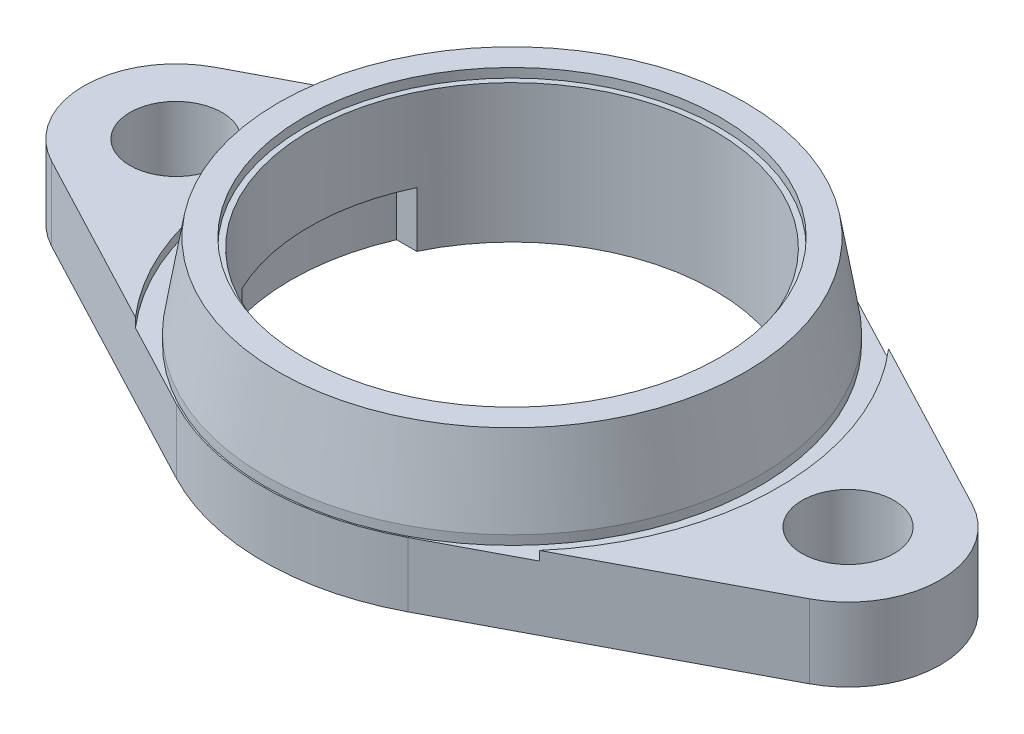
ISO-10303-21;
HEADER;
FILE_DESCRIPTION(('STEP AP214'),'2;1');
FILE_NAME('part.step','',(''),(''),'','','');
FILE_SCHEMA(('AUTOMOTIVE_DESIGN { 1 0 10303 214 1 1 1 1 }'));
ENDSEC;
DATA;
#1=APPLICATION_CONTEXT('core data for automotive mechanical design processes');
#2=APPLICATION_PROTOCOL_DEFINITION('international standard','automotive_design',2000,#1);
#3=PRODUCT_CONTEXT('',#1,'mechanical');
#4=PRODUCT('Part','Part','',(#3));
#5=PRODUCT_RELATED_PRODUCT_CATEGORY('part','',(#4));
#6=PRODUCT_DEFINITION_FORMATION('','',#4);
#7=PRODUCT_DEFINITION_CONTEXT('part definition',#1,'design');
#8=PRODUCT_DEFINITION('design','',#6,#7);
#9=PRODUCT_DEFINITION_SHAPE('','',#8);
#10=(LENGTH_UNIT() NAMED_UNIT(*) SI_UNIT(.MILLI.,.METRE.));
#11=(NAMED_UNIT(*) PLANE_ANGLE_UNIT() SI_UNIT($,.RADIAN.));
#12=(NAMED_UNIT(*) SI_UNIT($,.STERADIAN.) SOLID_ANGLE_UNIT());
#13=UNCERTAINTY_MEASURE_WITH_UNIT(LENGTH_MEASURE(1.E-05),#10,'distance_accuracy_value','');
#14=(GEOMETRIC_REPRESENTATION_CONTEXT(3) GLOBAL_UNCERTAINTY_ASSIGNED_CONTEXT((#13)) GLOBAL_UNIT_ASSIGNED_CONTEXT((#10,
#11,#12)) REPRESENTATION_CONTEXT('',''));
#15=CARTESIAN_POINT('',(0.,0.,0.));
#16=DIRECTION('',(0.,0.,1.));
#17=DIRECTION('',(1.,0.,0.));
#18=AXIS2_PLACEMENT_3D('',#15,#16,#17);
#19=CARTESIAN_POINT('',(0.,4.,0.));
#20=DIRECTION('',(0.,-1.,0.));
#21=DIRECTION('',(0.,0.,-1.));
#22=AXIS2_PLACEMENT_3D('',#19,#20,#21);
#23=CYLINDRICAL_SURFACE('',#22,11.);
#24=DIRECTION('',(0.,-1.,0.));
#25=VECTOR('',#24,1.);
#26=CARTESIAN_POINT('',(9.92156741649221,4.,4.75));
#27=LINE('',#26,#25);
#28=CARTESIAN_POINT('',(9.92156741649221,0.5,4.75));
#29=VERTEX_POINT('',#28);
#30=CARTESIAN_POINT('',(9.92156741649221,3.5,4.75));
#31=VERTEX_POINT('',#30);
#32=EDGE_CURVE('E268',#29,#31,#27,.F.);
#33=ORIENTED_EDGE('',*,*,#32,.F.);
#34=CARTESIAN_POINT('',(0.,0.5,0.));
#35=DIRECTION('',(0.,-1.,0.));
#36=DIRECTION('',(0.,0.,-1.));
#37=AXIS2_PLACEMENT_3D('',#34,#35,#36);
#38=CIRCLE('',#37,11.);
#39=CARTESIAN_POINT('',(-9.92156741649221,0.5,4.75));
#40=VERTEX_POINT('',#39);
#41=EDGE_CURVE('E344',#29,#40,#38,.T.);
#42=ORIENTED_EDGE('',*,*,#41,.T.);
#43=DIRECTION('',(0.,-1.,0.));
#44=VECTOR('',#43,1.);
#45=CARTESIAN_POINT('',(-9.92156741649221,4.,4.75));
#46=LINE('',#45,#44);
#47=CARTESIAN_POINT('',(-9.92156741649221,3.5,4.75));
#48=VERTEX_POINT('',#47);
#49=EDGE_CURVE('E270',#48,#40,#46,.T.);
#50=ORIENTED_EDGE('',*,*,#49,.F.);
#51=CARTESIAN_POINT('',(0.,3.5,0.));
#52=DIRECTION('',(0.,-1.,0.));
#53=DIRECTION('',(0.,0.,-1.));
#54=AXIS2_PLACEMENT_3D('',#51,#52,#53);
#55=CIRCLE('',#54,11.);
#56=CARTESIAN_POINT('',(-9.92156741649221,3.5,-4.75));
#57=VERTEX_POINT('',#56);
#58=EDGE_CURVE('E38',#48,#57,#55,.T.);
#59=ORIENTED_EDGE('',*,*,#58,.T.);
#60=DIRECTION('',(0.,-1.,0.));
#61=VECTOR('',#60,1.);
#62=CARTESIAN_POINT('',(-9.92156741649221,4.,-4.75));
#63=LINE('',#62,#61);
#64=CARTESIAN_POINT('',(-9.92156741649221,0.5,-4.75));
#65=VERTEX_POINT('',#64);
#66=EDGE_CURVE('E233',#65,#57,#63,.F.);
#67=ORIENTED_EDGE('',*,*,#66,.F.);
#68=CARTESIAN_POINT('',(9.92156741649221,0.5,-4.75));
#69=VERTEX_POINT('',#68);
#70=EDGE_CURVE('E322',#65,#69,#38,.T.);
#71=ORIENTED_EDGE('',*,*,#70,.T.);
#72=DIRECTION('',(0.,-1.,0.));
#73=VECTOR('',#72,1.);
#74=CARTESIAN_POINT('',(9.92156741649221,4.,-4.75));
#75=LINE('',#74,#73);
#76=CARTESIAN_POINT('',(9.92156741649221,3.5,-4.75));
#77=VERTEX_POINT('',#76);
#78=EDGE_CURVE('E57',#77,#69,#75,.T.);
#79=ORIENTED_EDGE('',*,*,#78,.F.);
#80=EDGE_CURVE('E11',#77,#31,#55,.T.);
#81=ORIENTED_EDGE('',*,*,#80,.T.);
#82=EDGE_LOOP('',(#33,#42,#50,#59,#67,#71,#79,#81));
#83=FACE_BOUND('',#82,.T.);
#84=CARTESIAN_POINT('',(0.,8.,0.));
#85=DIRECTION('',(0.,-1.,0.));
#86=DIRECTION('',(0.,0.,-1.));
#87=AXIS2_PLACEMENT_3D('',#84,#85,#86);
#88=CIRCLE('',#87,11.);
#89=CARTESIAN_POINT('',(0.,8.,-11.));
#90=VERTEX_POINT('',#89);
#91=EDGE_CURVE('E387',#90,#90,#88,.T.);
#92=ORIENTED_EDGE('',*,*,#91,.F.);
#93=EDGE_LOOP('',(#92));
#94=FACE_BOUND('',#93,.T.);
#95=ADVANCED_FACE('F34',(#83,#94),#23,.F.);
#96=CARTESIAN_POINT('',(18.25,4.,0.));
#97=DIRECTION('',(0.,1.,0.));
#98=DIRECTION('',(0.,0.,1.));
#99=AXIS2_PLACEMENT_3D('',#96,#97,#98);
#100=PLANE('',#99);
#101=CARTESIAN_POINT('',(18.25,4.,0.));
#102=DIRECTION('',(0.,1.,0.));
#103=DIRECTION('',(0.,0.,1.));
#104=AXIS2_PLACEMENT_3D('',#101,#102,#103);
#105=CIRCLE('',#104,2.5);
#106=CARTESIAN_POINT('',(18.25,4.,2.5));
#107=VERTEX_POINT('',#106);
#108=EDGE_CURVE('E896',#107,#107,#105,.T.);
#109=ORIENTED_EDGE('',*,*,#108,.F.);
#110=EDGE_LOOP('',(#109));
#111=FACE_BOUND('',#110,.T.);
#112=CARTESIAN_POINT('',(0.,4.,0.));
#113=DIRECTION('',(0.,1.,0.));
#114=DIRECTION('',(0.,0.,1.));
#115=AXIS2_PLACEMENT_3D('',#112,#113,#114);
#116=CIRCLE('',#115,14.5);
#117=CARTESIAN_POINT('',(10.9701988545522,4.,9.48181085508363));
#118=VERTEX_POINT('',#117);
#119=CARTESIAN_POINT('',(10.9701988545522,4.,-9.48181085508363));
#120=VERTEX_POINT('',#119);
#121=EDGE_CURVE('E340',#118,#120,#116,.T.);
#122=ORIENTED_EDGE('',*,*,#121,.F.);
#123=DIRECTION('',(0.884914542438861,0.,-0.465753424657534));
#124=VECTOR('',#123,1.);
#125=CARTESIAN_POINT('',(6.28767123287671,4.,11.9463463229246));
#126=LINE('',#125,#124);
#127=CARTESIAN_POINT('',(20.5787671232877,4.,4.4245727121943));
#128=VERTEX_POINT('',#127);
#129=EDGE_CURVE('E405',#118,#128,#126,.T.);
#130=ORIENTED_EDGE('',*,*,#129,.T.);
#131=CARTESIAN_POINT('',(18.25,4.,0.));
#132=DIRECTION('',(0.,1.,0.));
#133=DIRECTION('',(0.,0.,1.));
#134=AXIS2_PLACEMENT_3D('',#131,#132,#133);
#135=CIRCLE('',#134,5.);
#136=CARTESIAN_POINT('',(20.5787671232877,4.,-4.4245727121943));
#137=VERTEX_POINT('',#136);
#138=EDGE_CURVE('E391',#128,#137,#135,.T.);
#139=ORIENTED_EDGE('',*,*,#138,.T.);
#140=DIRECTION('',(-0.884914542438861,0.,-0.465753424657534));
#141=VECTOR('',#140,1.);
#142=CARTESIAN_POINT('',(20.5787671232877,4.,-4.4245727121943));
#143=LINE('',#142,#141);
#144=EDGE_CURVE('E394',#137,#120,#143,.T.);
#145=ORIENTED_EDGE('',*,*,#144,.T.);
#146=EDGE_LOOP('',(#122,#130,#139,#145));
#147=FACE_BOUND('',#146,.T.);
#148=ADVANCED_FACE('F485',(#111,#147),#100,.T.);
#149=CARTESIAN_POINT('',(0.,4.,0.));
#150=DIRECTION('',(0.,-1.,0.));
#151=DIRECTION('',(0.,0.,-1.));
#152=AXIS2_PLACEMENT_3D('',#149,#150,#151);
#153=CYLINDRICAL_SURFACE('',#152,13.5);
#154=CARTESIAN_POINT('',(0.,3.5,0.));
#155=DIRECTION('',(0.,1.,0.));
#156=DIRECTION('',(0.,0.,1.));
#157=AXIS2_PLACEMENT_3D('',#154,#155,#156);
#158=CIRCLE('',#157,13.5);
#159=CARTESIAN_POINT('',(6.28767123287671,3.5,-11.9463463229246));
#160=VERTEX_POINT('',#159);
#161=CARTESIAN_POINT('',(-6.28767123287671,3.5,-11.9463463229246));
#162=VERTEX_POINT('',#161);
#163=EDGE_CURVE('E351',#160,#162,#158,.T.);
#164=ORIENTED_EDGE('',*,*,#163,.F.);
#165=DIRECTION('',(0.,-1.,0.));
#166=VECTOR('',#165,1.);
#167=CARTESIAN_POINT('',(6.28767123287672,4.,-11.9463463229246));
#168=LINE('',#167,#166);
#169=CARTESIAN_POINT('',(6.28767123287672,0.,-11.9463463229246));
#170=VERTEX_POINT('',#169);
#171=EDGE_CURVE('E441',#160,#170,#168,.T.);
#172=ORIENTED_EDGE('',*,*,#171,.T.);
#173=CARTESIAN_POINT('',(0.,0.,0.));
#174=DIRECTION('',(0.,1.,0.));
#175=DIRECTION('',(0.,0.,1.));
#176=AXIS2_PLACEMENT_3D('',#173,#174,#175);
#177=CIRCLE('',#176,13.5);
#178=CARTESIAN_POINT('',(-6.28767123287671,0.,-11.9463463229246));
#179=VERTEX_POINT('',#178);
#180=EDGE_CURVE('E413',#170,#179,#177,.T.);
#181=ORIENTED_EDGE('',*,*,#180,.T.);
#182=DIRECTION('',(0.,-1.,0.));
#183=VECTOR('',#182,1.);
#184=CARTESIAN_POINT('',(-6.28767123287671,4.,-11.9463463229246));
#185=LINE('',#184,#183);
#186=EDGE_CURVE('E439',#162,#179,#185,.T.);
#187=ORIENTED_EDGE('',*,*,#186,.F.);
#188=EDGE_LOOP('',(#164,#172,#181,#187));
#189=FACE_BOUND('',#188,.T.);
#190=ADVANCED_FACE('F490',(#189),#153,.T.);
#191=CARTESIAN_POINT('',(0.,4.,0.));
#192=DIRECTION('',(0.,-1.,0.));
#193=DIRECTION('',(0.,0.,-1.));
#194=AXIS2_PLACEMENT_3D('',#191,#192,#193);
#195=CYLINDRICAL_SURFACE('',#194,13.5);
#196=CARTESIAN_POINT('',(0.,3.5,0.));
#197=DIRECTION('',(0.,1.,0.));
#198=DIRECTION('',(0.,0.,1.));
#199=AXIS2_PLACEMENT_3D('',#196,#197,#198);
#200=CIRCLE('',#199,13.5);
#201=CARTESIAN_POINT('',(-6.28767123287672,3.5,11.9463463229246));
#202=VERTEX_POINT('',#201);
#203=CARTESIAN_POINT('',(6.28767123287671,3.5,11.9463463229246));
#204=VERTEX_POINT('',#203);
#205=EDGE_CURVE('E361',#202,#204,#200,.T.);
#206=ORIENTED_EDGE('',*,*,#205,.F.);
#207=DIRECTION('',(0.,-1.,0.));
#208=VECTOR('',#207,1.);
#209=CARTESIAN_POINT('',(-6.28767123287672,4.,11.9463463229246));
#210=LINE('',#209,#208);
#211=CARTESIAN_POINT('',(-6.28767123287672,0.,11.9463463229246));
#212=VERTEX_POINT('',#211);
#213=EDGE_CURVE('E431',#202,#212,#210,.T.);
#214=ORIENTED_EDGE('',*,*,#213,.T.);
#215=CARTESIAN_POINT('',(0.,0.,0.));
#216=DIRECTION('',(0.,1.,0.));
#217=DIRECTION('',(0.,0.,1.));
#218=AXIS2_PLACEMENT_3D('',#215,#216,#217);
#219=CIRCLE('',#218,13.5);
#220=CARTESIAN_POINT('',(6.28767123287671,0.,11.9463463229246));
#221=VERTEX_POINT('',#220);
#222=EDGE_CURVE('E423',#212,#221,#219,.T.);
#223=ORIENTED_EDGE('',*,*,#222,.T.);
#224=DIRECTION('',(0.,-1.,0.));
#225=VECTOR('',#224,1.);
#226=CARTESIAN_POINT('',(6.28767123287671,4.,11.9463463229246));
#227=LINE('',#226,#225);
#228=EDGE_CURVE('E429',#204,#221,#227,.T.);
#229=ORIENTED_EDGE('',*,*,#228,.F.);
#230=EDGE_LOOP('',(#206,#214,#223,#229));
#231=FACE_BOUND('',#230,.T.);
#232=ADVANCED_FACE('F500',(#231),#195,.T.);
#233=CARTESIAN_POINT('',(-18.25,4.,0.));
#234=DIRECTION('',(0.,1.,0.));
#235=DIRECTION('',(0.,0.,1.));
#236=AXIS2_PLACEMENT_3D('',#233,#234,#235);
#237=CIRCLE('',#236,2.5);
#238=CARTESIAN_POINT('',(-18.25,4.,2.5));
#239=VERTEX_POINT('',#238);
#240=EDGE_CURVE('E898',#239,#239,#237,.T.);
#241=ORIENTED_EDGE('',*,*,#240,.F.);
#242=EDGE_LOOP('',(#241));
#243=FACE_BOUND('',#242,.T.);
#244=CARTESIAN_POINT('',(0.,4.,0.));
#245=DIRECTION('',(0.,1.,0.));
#246=DIRECTION('',(0.,0.,1.));
#247=AXIS2_PLACEMENT_3D('',#244,#245,#246);
#248=CIRCLE('',#247,14.5);
#249=CARTESIAN_POINT('',(-10.9701988545522,4.,-9.48181085508363));
#250=VERTEX_POINT('',#249);
#251=CARTESIAN_POINT('',(-10.9701988545522,4.,9.48181085508364));
#252=VERTEX_POINT('',#251);
#253=EDGE_CURVE('E349',#250,#252,#248,.T.);
#254=ORIENTED_EDGE('',*,*,#253,.F.);
#255=DIRECTION('',(-0.884914542438861,0.,0.465753424657534));
#256=VECTOR('',#255,1.);
#257=CARTESIAN_POINT('',(-20.5787671232877,4.,-4.4245727121943));
#258=LINE('',#257,#256);
#259=CARTESIAN_POINT('',(-20.5787671232877,4.,-4.4245727121943));
#260=VERTEX_POINT('',#259);
#261=EDGE_CURVE('E398',#250,#260,#258,.T.);
#262=ORIENTED_EDGE('',*,*,#261,.T.);
#263=CARTESIAN_POINT('',(-18.25,4.,0.));
#264=DIRECTION('',(0.,1.,0.));
#265=DIRECTION('',(0.,0.,1.));
#266=AXIS2_PLACEMENT_3D('',#263,#264,#265);
#267=CIRCLE('',#266,5.);
#268=CARTESIAN_POINT('',(-20.5787671232877,4.,4.4245727121943));
#269=VERTEX_POINT('',#268);
#270=EDGE_CURVE('E400',#260,#269,#267,.T.);
#271=ORIENTED_EDGE('',*,*,#270,.T.);
#272=DIRECTION('',(0.884914542438861,0.,0.465753424657535));
#273=VECTOR('',#272,1.);
#274=CARTESIAN_POINT('',(-20.5787671232877,4.,4.4245727121943));
#275=LINE('',#274,#273);
#276=EDGE_CURVE('E402',#269,#252,#275,.T.);
#277=ORIENTED_EDGE('',*,*,#276,.T.);
#278=EDGE_LOOP('',(#254,#262,#271,#277));
#279=FACE_BOUND('',#278,.T.);
#280=ADVANCED_FACE('F493',(#243,#279),#100,.T.);
#281=CARTESIAN_POINT('',(18.25,0.,0.));
#282=DIRECTION('',(0.,1.,0.));
#283=DIRECTION('',(0.,0.,1.));
#284=AXIS2_PLACEMENT_3D('',#281,#282,#283);
#285=PLANE('',#284);
#286=CARTESIAN_POINT('',(18.25,0.,0.));
#287=DIRECTION('',(0.,1.,0.));
#288=DIRECTION('',(0.,0.,1.));
#289=AXIS2_PLACEMENT_3D('',#286,#287,#288);
#290=CIRCLE('',#289,2.5);
#291=CARTESIAN_POINT('',(18.25,0.,2.5));
#292=VERTEX_POINT('',#291);
#293=EDGE_CURVE('E893',#292,#292,#290,.T.);
#294=ORIENTED_EDGE('',*,*,#293,.T.);
#295=EDGE_LOOP('',(#294));
#296=FACE_BOUND('',#295,.T.);
#297=CARTESIAN_POINT('',(-18.25,0.,0.));
#298=DIRECTION('',(0.,1.,0.));
#299=DIRECTION('',(0.,0.,1.));
#300=AXIS2_PLACEMENT_3D('',#297,#298,#299);
#301=CIRCLE('',#300,2.5);
#302=CARTESIAN_POINT('',(-18.25,0.,2.5));
#303=VERTEX_POINT('',#302);
#304=EDGE_CURVE('E248',#303,#303,#301,.T.);
#305=ORIENTED_EDGE('',*,*,#304,.T.);
#306=EDGE_LOOP('',(#305));
#307=FACE_BOUND('',#306,.T.);
#308=DIRECTION('',(-0.884914542438861,0.,-0.465753424657535));
#309=VECTOR('',#308,1.);
#310=CARTESIAN_POINT('',(-5.47260273972603,0.,10.3977458736566));
#311=LINE('',#310,#309);
#312=CARTESIAN_POINT('',(-5.47260273972603,0.,10.3977458736566));
#313=VERTEX_POINT('',#312);
#314=CARTESIAN_POINT('',(-17.009424328596,0.,4.32561810652773));
#315=VERTEX_POINT('',#314);
#316=EDGE_CURVE('E300',#313,#315,#311,.T.);
#317=ORIENTED_EDGE('',*,*,#316,.F.);
#318=CARTESIAN_POINT('',(0.,0.,0.));
#319=DIRECTION('',(0.,-1.,0.));
#320=DIRECTION('',(0.,0.,-1.));
#321=AXIS2_PLACEMENT_3D('',#318,#319,#320);
#322=CIRCLE('',#321,11.75);
#323=CARTESIAN_POINT('',(5.47260273972603,0.,10.3977458736566));
#324=VERTEX_POINT('',#323);
#325=EDGE_CURVE('E272',#324,#313,#322,.T.);
#326=ORIENTED_EDGE('',*,*,#325,.F.);
#327=DIRECTION('',(-0.884914542438861,0.,0.465753424657535));
#328=VECTOR('',#327,1.);
#329=CARTESIAN_POINT('',(17.009424328596,0.,4.32561810652772));
#330=LINE('',#329,#328);
#331=CARTESIAN_POINT('',(17.009424328596,0.,4.32561810652772));
#332=VERTEX_POINT('',#331);
#333=EDGE_CURVE('E277',#332,#324,#330,.T.);
#334=ORIENTED_EDGE('',*,*,#333,.F.);
#335=CARTESIAN_POINT('',(18.25,0.,0.));
#336=DIRECTION('',(0.,1.,0.));
#337=DIRECTION('',(0.,0.,-1.));
#338=AXIS2_PLACEMENT_3D('',#335,#336,#337);
#339=CIRCLE('',#338,4.5);
#340=CARTESIAN_POINT('',(17.009424328596,0.,-4.32561810652773));
#341=VERTEX_POINT('',#340);
#342=EDGE_CURVE('E315',#341,#332,#339,.T.);
#343=ORIENTED_EDGE('',*,*,#342,.F.);
#344=DIRECTION('',(0.884914542438861,0.,0.465753424657534));
#345=VECTOR('',#344,1.);
#346=CARTESIAN_POINT('',(5.47260273972603,0.,-10.3977458736566));
#347=LINE('',#346,#345);
#348=CARTESIAN_POINT('',(5.47260273972603,0.,-10.3977458736566));
#349=VERTEX_POINT('',#348);
#350=EDGE_CURVE('E312',#349,#341,#347,.T.);
#351=ORIENTED_EDGE('',*,*,#350,.F.);
#352=CARTESIAN_POINT('',(0.,0.,0.));
#353=DIRECTION('',(0.,-1.,0.));
#354=DIRECTION('',(0.,0.,-1.));
#355=AXIS2_PLACEMENT_3D('',#352,#353,#354);
#356=CIRCLE('',#355,11.75);
#357=CARTESIAN_POINT('',(-5.47260273972603,0.,-10.3977458736566));
#358=VERTEX_POINT('',#357);
#359=EDGE_CURVE('E309',#358,#349,#356,.T.);
#360=ORIENTED_EDGE('',*,*,#359,.F.);
#361=DIRECTION('',(0.884914542438861,0.,-0.465753424657534));
#362=VECTOR('',#361,1.);
#363=CARTESIAN_POINT('',(-17.009424328596,0.,-4.32561810652773));
#364=LINE('',#363,#362);
#365=CARTESIAN_POINT('',(-17.009424328596,0.,-4.32561810652773));
#366=VERTEX_POINT('',#365);
#367=EDGE_CURVE('E306',#366,#358,#364,.T.);
#368=ORIENTED_EDGE('',*,*,#367,.F.);
#369=CARTESIAN_POINT('',(-18.25,0.,0.));
#370=DIRECTION('',(0.,1.,0.));
#371=DIRECTION('',(0.,0.,-1.));
#372=AXIS2_PLACEMENT_3D('',#369,#370,#371);
#373=CIRCLE('',#372,4.5);
#374=EDGE_CURVE('E303',#315,#366,#373,.T.);
#375=ORIENTED_EDGE('',*,*,#374,.F.);
#376=EDGE_LOOP('',(#317,#326,#334,#343,#351,#360,#368,#375));
#377=FACE_BOUND('',#376,.T.);
#378=CARTESIAN_POINT('',(18.25,0.,0.));
#379=DIRECTION('',(0.,1.,0.));
#380=DIRECTION('',(0.,0.,1.));
#381=AXIS2_PLACEMENT_3D('',#378,#379,#380);
#382=CIRCLE('',#381,5.);
#383=CARTESIAN_POINT('',(20.5787671232877,0.,4.4245727121943));
#384=VERTEX_POINT('',#383);
#385=CARTESIAN_POINT('',(20.5787671232877,0.,-4.4245727121943));
#386=VERTEX_POINT('',#385);
#387=EDGE_CURVE('E390',#384,#386,#382,.T.);
#388=ORIENTED_EDGE('',*,*,#387,.F.);
#389=DIRECTION('',(0.884914542438861,0.,-0.465753424657534));
#390=VECTOR('',#389,1.);
#391=CARTESIAN_POINT('',(6.28767123287671,0.,11.9463463229246));
#392=LINE('',#391,#390);
#393=EDGE_CURVE('E395',#221,#384,#392,.T.);
#394=ORIENTED_EDGE('',*,*,#393,.F.);
#395=ORIENTED_EDGE('',*,*,#222,.F.);
#396=DIRECTION('',(0.884914542438861,0.,0.465753424657535));
#397=VECTOR('',#396,1.);
#398=CARTESIAN_POINT('',(-20.5787671232877,0.,4.4245727121943));
#399=LINE('',#398,#397);
#400=CARTESIAN_POINT('',(-20.5787671232877,0.,4.4245727121943));
#401=VERTEX_POINT('',#400);
#402=EDGE_CURVE('E420',#401,#212,#399,.T.);
#403=ORIENTED_EDGE('',*,*,#402,.F.);
#404=CARTESIAN_POINT('',(-18.25,0.,0.));
#405=DIRECTION('',(0.,1.,0.));
#406=DIRECTION('',(0.,0.,1.));
#407=AXIS2_PLACEMENT_3D('',#404,#405,#406);
#408=CIRCLE('',#407,5.);
#409=CARTESIAN_POINT('',(-20.5787671232877,0.,-4.4245727121943));
#410=VERTEX_POINT('',#409);
#411=EDGE_CURVE('E418',#410,#401,#408,.T.);
#412=ORIENTED_EDGE('',*,*,#411,.F.);
#413=DIRECTION('',(-0.884914542438861,0.,0.465753424657534));
#414=VECTOR('',#413,1.);
#415=CARTESIAN_POINT('',(-20.5787671232877,0.,-4.4245727121943));
#416=LINE('',#415,#414);
#417=EDGE_CURVE('E416',#179,#410,#416,.T.);
#418=ORIENTED_EDGE('',*,*,#417,.F.);
#419=ORIENTED_EDGE('',*,*,#180,.F.);
#420=DIRECTION('',(-0.884914542438861,0.,-0.465753424657534));
#421=VECTOR('',#420,1.);
#422=CARTESIAN_POINT('',(20.5787671232877,0.,-4.4245727121943));
#423=LINE('',#422,#421);
#424=EDGE_CURVE('E410',#386,#170,#423,.T.);
#425=ORIENTED_EDGE('',*,*,#424,.F.);
#426=EDGE_LOOP('',(#388,#394,#395,#403,#412,#418,#419,#425));
#427=FACE_BOUND('',#426,.T.);
#428=ADVANCED_FACE('F499',(#296,#307,#377,#427),#285,.F.);
#429=CARTESIAN_POINT('',(18.25,4.,0.));
#430=DIRECTION('',(0.,-1.,0.));
#431=DIRECTION('',(0.,0.,-1.));
#432=AXIS2_PLACEMENT_3D('',#429,#430,#431);
#433=CYLINDRICAL_SURFACE('',#432,5.);
#434=ORIENTED_EDGE('',*,*,#387,.T.);
#435=DIRECTION('',(0.,-1.,0.));
#436=VECTOR('',#435,1.);
#437=CARTESIAN_POINT('',(20.5787671232877,4.,-4.4245727121943));
#438=LINE('',#437,#436);
#439=EDGE_CURVE('E443',#137,#386,#438,.T.);
#440=ORIENTED_EDGE('',*,*,#439,.F.);
#441=ORIENTED_EDGE('',*,*,#138,.F.);
#442=DIRECTION('',(0.,-1.,0.));
#443=VECTOR('',#442,1.);
#444=CARTESIAN_POINT('',(20.5787671232877,4.,4.4245727121943));
#445=LINE('',#444,#443);
#446=EDGE_CURVE('E407',#128,#384,#445,.T.);
#447=ORIENTED_EDGE('',*,*,#446,.T.);
#448=EDGE_LOOP('',(#434,#440,#441,#447));
#449=FACE_BOUND('',#448,.T.);
#450=ADVANCED_FACE('F36',(#449),#433,.T.);
#451=CARTESIAN_POINT('',(20.5787671232877,4.,-4.4245727121943));
#452=DIRECTION('',(-0.465753424657534,0.,0.884914542438861));
#453=DIRECTION('',(0.884914542438861,0.,0.465753424657535));
#454=AXIS2_PLACEMENT_3D('',#451,#452,#453);
#455=PLANE('',#454);
#456=DIRECTION('',(-0.884914542438861,0.,-0.465753424657535));
#457=VECTOR('',#456,1.);
#458=CARTESIAN_POINT('',(10.9701988545522,3.5,-9.48181085508363));
#459=LINE('',#458,#457);
#460=CARTESIAN_POINT('',(10.9701988545522,3.5,-9.48181085508363));
#461=VERTEX_POINT('',#460);
#462=EDGE_CURVE('E348',#461,#160,#459,.T.);
#463=ORIENTED_EDGE('',*,*,#462,.F.);
#464=DIRECTION('',(0.,1.,0.));
#465=VECTOR('',#464,1.);
#466=CARTESIAN_POINT('',(10.9701988545522,3.5,-9.48181085508363));
#467=LINE('',#466,#465);
#468=EDGE_CURVE('E366',#461,#120,#467,.T.);
#469=ORIENTED_EDGE('',*,*,#468,.T.);
#470=ORIENTED_EDGE('',*,*,#144,.F.);
#471=ORIENTED_EDGE('',*,*,#439,.T.);
#472=ORIENTED_EDGE('',*,*,#424,.T.);
#473=ORIENTED_EDGE('',*,*,#171,.F.);
#474=EDGE_LOOP('',(#463,#469,#470,#471,#472,#473));
#475=FACE_BOUND('',#474,.T.);
#476=ADVANCED_FACE('F523',(#475),#455,.F.);
#477=CARTESIAN_POINT('',(-20.5787671232877,4.,-4.4245727121943));
#478=DIRECTION('',(0.465753424657534,0.,0.884914542438861));
#479=DIRECTION('',(0.884914542438861,0.,-0.465753424657534));
#480=AXIS2_PLACEMENT_3D('',#477,#478,#479);
#481=PLANE('',#480);
#482=ORIENTED_EDGE('',*,*,#261,.F.);
#483=DIRECTION('',(0.,1.,0.));
#484=VECTOR('',#483,1.);
#485=CARTESIAN_POINT('',(-10.9701988545522,3.5,-9.48181085508363));
#486=LINE('',#485,#484);
#487=CARTESIAN_POINT('',(-10.9701988545522,3.5,-9.48181085508363));
#488=VERTEX_POINT('',#487);
#489=EDGE_CURVE('E375',#488,#250,#486,.T.);
#490=ORIENTED_EDGE('',*,*,#489,.F.);
#491=DIRECTION('',(-0.884914542438861,0.,0.465753424657535));
#492=VECTOR('',#491,1.);
#493=CARTESIAN_POINT('',(-6.28767123287671,3.5,-11.9463463229246));
#494=LINE('',#493,#492);
#495=EDGE_CURVE('E353',#162,#488,#494,.T.);
#496=ORIENTED_EDGE('',*,*,#495,.F.);
#497=ORIENTED_EDGE('',*,*,#186,.T.);
#498=ORIENTED_EDGE('',*,*,#417,.T.);
#499=DIRECTION('',(0.,-1.,0.));
#500=VECTOR('',#499,1.);
#501=CARTESIAN_POINT('',(-20.5787671232877,4.,-4.4245727121943));
#502=LINE('',#501,#500);
#503=EDGE_CURVE('E436',#260,#410,#502,.T.);
#504=ORIENTED_EDGE('',*,*,#503,.F.);
#505=EDGE_LOOP('',(#482,#490,#496,#497,#498,#504));
#506=FACE_BOUND('',#505,.T.);
#507=ADVANCED_FACE('F519',(#506),#481,.F.);
#508=CARTESIAN_POINT('',(-18.25,4.,0.));
#509=DIRECTION('',(0.,-1.,0.));
#510=DIRECTION('',(0.,0.,-1.));
#511=AXIS2_PLACEMENT_3D('',#508,#509,#510);
#512=CYLINDRICAL_SURFACE('',#511,5.);
#513=ORIENTED_EDGE('',*,*,#411,.T.);
#514=DIRECTION('',(0.,-1.,0.));
#515=VECTOR('',#514,1.);
#516=CARTESIAN_POINT('',(-20.5787671232877,4.,4.4245727121943));
#517=LINE('',#516,#515);
#518=EDGE_CURVE('E433',#269,#401,#517,.T.);
#519=ORIENTED_EDGE('',*,*,#518,.F.);
#520=ORIENTED_EDGE('',*,*,#270,.F.);
#521=ORIENTED_EDGE('',*,*,#503,.T.);
#522=EDGE_LOOP('',(#513,#519,#520,#521));
#523=FACE_BOUND('',#522,.T.);
#524=ADVANCED_FACE('F515',(#523),#512,.T.);
#525=CARTESIAN_POINT('',(-20.5787671232877,4.,4.4245727121943));
#526=DIRECTION('',(0.465753424657535,0.,-0.884914542438861));
#527=DIRECTION('',(-0.884914542438861,0.,-0.465753424657535));
#528=AXIS2_PLACEMENT_3D('',#525,#526,#527);
#529=PLANE('',#528);
#530=DIRECTION('',(0.884914542438861,0.,0.465753424657535));
#531=VECTOR('',#530,1.);
#532=CARTESIAN_POINT('',(-10.9701988545522,3.5,9.48181085508364));
#533=LINE('',#532,#531);
#534=CARTESIAN_POINT('',(-10.9701988545522,3.5,9.48181085508364));
#535=VERTEX_POINT('',#534);
#536=EDGE_CURVE('E359',#535,#202,#533,.T.);
#537=ORIENTED_EDGE('',*,*,#536,.F.);
#538=DIRECTION('',(0.,1.,0.));
#539=VECTOR('',#538,1.);
#540=CARTESIAN_POINT('',(-10.9701988545522,3.5,9.48181085508364));
#541=LINE('',#540,#539);
#542=EDGE_CURVE('E372',#535,#252,#541,.T.);
#543=ORIENTED_EDGE('',*,*,#542,.T.);
#544=ORIENTED_EDGE('',*,*,#276,.F.);
#545=ORIENTED_EDGE('',*,*,#518,.T.);
#546=ORIENTED_EDGE('',*,*,#402,.T.);
#547=ORIENTED_EDGE('',*,*,#213,.F.);
#548=EDGE_LOOP('',(#537,#543,#544,#545,#546,#547));
#549=FACE_BOUND('',#548,.T.);
#550=ADVANCED_FACE('F508',(#549),#529,.F.);
#551=CARTESIAN_POINT('',(6.28767123287671,4.,11.9463463229246));
#552=DIRECTION('',(-0.465753424657534,0.,-0.884914542438861));
#553=DIRECTION('',(-0.884914542438861,0.,0.465753424657534));
#554=AXIS2_PLACEMENT_3D('',#551,#552,#553);
#555=PLANE('',#554);
#556=ORIENTED_EDGE('',*,*,#129,.F.);
#557=DIRECTION('',(0.,1.,0.));
#558=VECTOR('',#557,1.);
#559=CARTESIAN_POINT('',(10.9701988545522,3.5,9.48181085508363));
#560=LINE('',#559,#558);
#561=CARTESIAN_POINT('',(10.9701988545522,3.5,9.48181085508363));
#562=VERTEX_POINT('',#561);
#563=EDGE_CURVE('E369',#562,#118,#560,.T.);
#564=ORIENTED_EDGE('',*,*,#563,.F.);
#565=DIRECTION('',(0.884914542438861,0.,-0.465753424657535));
#566=VECTOR('',#565,1.);
#567=CARTESIAN_POINT('',(6.28767123287671,3.5,11.9463463229246));
#568=LINE('',#567,#566);
#569=EDGE_CURVE('E363',#204,#562,#568,.T.);
#570=ORIENTED_EDGE('',*,*,#569,.F.);
#571=ORIENTED_EDGE('',*,*,#228,.T.);
#572=ORIENTED_EDGE('',*,*,#393,.T.);
#573=ORIENTED_EDGE('',*,*,#446,.F.);
#574=EDGE_LOOP('',(#556,#564,#570,#571,#572,#573));
#575=FACE_BOUND('',#574,.T.);
#576=ADVANCED_FACE('F505',(#575),#555,.F.);
#577=CARTESIAN_POINT('',(-11.3,8.,0.));
#578=DIRECTION('',(0.,-1.,0.));
#579=DIRECTION('',(0.,0.,-1.));
#580=AXIS2_PLACEMENT_3D('',#577,#578,#579);
#581=PLANE('',#580);
#582=CARTESIAN_POINT('',(0.,8.,0.));
#583=DIRECTION('',(0.,-1.,0.));
#584=DIRECTION('',(0.,0.,-1.));
#585=AXIS2_PLACEMENT_3D('',#582,#583,#584);
#586=CIRCLE('',#585,11.3);
#587=CARTESIAN_POINT('',(0.,8.,-11.3));
#588=VERTEX_POINT('',#587);
#589=EDGE_CURVE('E384',#588,#588,#586,.T.);
#590=ORIENTED_EDGE('',*,*,#589,.F.);
#591=EDGE_LOOP('',(#590));
#592=FACE_BOUND('',#591,.T.);
#593=ORIENTED_EDGE('',*,*,#91,.T.);
#594=EDGE_LOOP('',(#593));
#595=FACE_BOUND('',#594,.T.);
#596=ADVANCED_FACE('F495',(#592,#595),#581,.F.);
#597=CARTESIAN_POINT('',(0.,0.,0.));
#598=DIRECTION('',(0.,-1.,0.));
#599=DIRECTION('',(0.,0.,-1.));
#600=AXIS2_PLACEMENT_3D('',#597,#598,#599);
#601=CYLINDRICAL_SURFACE('',#600,11.3);
#602=CARTESIAN_POINT('',(0.,8.5,0.));
#603=DIRECTION('',(0.,-1.,0.));
#604=DIRECTION('',(0.,0.,-1.));
#605=AXIS2_PLACEMENT_3D('',#602,#603,#604);
#606=CIRCLE('',#605,11.3);
#607=CARTESIAN_POINT('',(0.,8.5,-11.3));
#608=VERTEX_POINT('',#607);
#609=EDGE_CURVE('E381',#608,#608,#606,.T.);
#610=ORIENTED_EDGE('',*,*,#609,.F.);
#611=EDGE_LOOP('',(#610));
#612=FACE_BOUND('',#611,.T.);
#613=ORIENTED_EDGE('',*,*,#589,.T.);
#614=EDGE_LOOP('',(#613));
#615=FACE_BOUND('',#614,.T.);
#616=ADVANCED_FACE('F590',(#612,#615),#601,.F.);
#617=CARTESIAN_POINT('',(-12.675,8.5,0.));
#618=DIRECTION('',(0.,-1.,0.));
#619=DIRECTION('',(0.,0.,-1.));
#620=AXIS2_PLACEMENT_3D('',#617,#618,#619);
#621=PLANE('',#620);
#622=CARTESIAN_POINT('',(0.,8.5,0.));
#623=DIRECTION('',(0.,-1.,0.));
#624=DIRECTION('',(0.,0.,-1.));
#625=AXIS2_PLACEMENT_3D('',#622,#623,#624);
#626=CIRCLE('',#625,12.675);
#627=CARTESIAN_POINT('',(0.,8.5,-12.675));
#628=VERTEX_POINT('',#627);
#629=EDGE_CURVE('E371',#628,#628,#626,.T.);
#630=ORIENTED_EDGE('',*,*,#629,.F.);
#631=EDGE_LOOP('',(#630));
#632=FACE_BOUND('',#631,.T.);
#633=ORIENTED_EDGE('',*,*,#609,.T.);
#634=EDGE_LOOP('',(#633));
#635=FACE_BOUND('',#634,.T.);
#636=ADVANCED_FACE('F587',(#632,#635),#621,.F.);
#637=CARTESIAN_POINT('',(0.,8.5,0.));
#638=DIRECTION('',(0.,-1.,0.));
#639=DIRECTION('',(0.,0.,-1.));
#640=AXIS2_PLACEMENT_3D('',#637,#638,#639);
#641=CONICAL_SURFACE('',#640,12.675,0.165148677414627);
#642=CARTESIAN_POINT('',(0.,4.,0.));
#643=DIRECTION('',(0.,1.,0.));
#644=DIRECTION('',(0.,0.,1.));
#645=AXIS2_PLACEMENT_3D('',#642,#643,#644);
#646=CIRCLE('',#645,13.425);
#647=CARTESIAN_POINT('',(0.,4.,13.425));
#648=VERTEX_POINT('',#647);
#649=EDGE_CURVE('E341',#648,#648,#646,.T.);
#650=ORIENTED_EDGE('',*,*,#649,.T.);
#651=EDGE_LOOP('',(#650));
#652=FACE_BOUND('',#651,.T.);
#653=ORIENTED_EDGE('',*,*,#629,.T.);
#654=EDGE_LOOP('',(#653));
#655=FACE_BOUND('',#654,.T.);
#656=ADVANCED_FACE('F581',(#652,#655),#641,.T.);
#657=CARTESIAN_POINT('',(0.,3.5,0.));
#658=DIRECTION('',(0.,1.,0.));
#659=DIRECTION('',(0.,0.,1.));
#660=AXIS2_PLACEMENT_3D('',#657,#658,#659);
#661=CYLINDRICAL_SURFACE('',#660,14.5);
#662=ORIENTED_EDGE('',*,*,#121,.T.);
#663=ORIENTED_EDGE('',*,*,#468,.F.);
#664=CARTESIAN_POINT('',(0.,3.5,0.));
#665=DIRECTION('',(0.,1.,0.));
#666=DIRECTION('',(0.,0.,1.));
#667=AXIS2_PLACEMENT_3D('',#664,#665,#666);
#668=CIRCLE('',#667,14.5);
#669=EDGE_CURVE('E345',#562,#461,#668,.T.);
#670=ORIENTED_EDGE('',*,*,#669,.F.);
#671=ORIENTED_EDGE('',*,*,#563,.T.);
#672=EDGE_LOOP('',(#662,#663,#670,#671));
#673=FACE_BOUND('',#672,.T.);
#674=ADVANCED_FACE('F560',(#673),#661,.F.);
#675=CARTESIAN_POINT('',(0.,3.5,0.));
#676=DIRECTION('',(0.,1.,0.));
#677=DIRECTION('',(0.,0.,1.));
#678=AXIS2_PLACEMENT_3D('',#675,#676,#677);
#679=CYLINDRICAL_SURFACE('',#678,14.5);
#680=ORIENTED_EDGE('',*,*,#253,.T.);
#681=ORIENTED_EDGE('',*,*,#542,.F.);
#682=CARTESIAN_POINT('',(0.,3.5,0.));
#683=DIRECTION('',(0.,1.,0.));
#684=DIRECTION('',(0.,0.,1.));
#685=AXIS2_PLACEMENT_3D('',#682,#683,#684);
#686=CIRCLE('',#685,14.5);
#687=EDGE_CURVE('E356',#488,#535,#686,.T.);
#688=ORIENTED_EDGE('',*,*,#687,.F.);
#689=ORIENTED_EDGE('',*,*,#489,.T.);
#690=EDGE_LOOP('',(#680,#681,#688,#689));
#691=FACE_BOUND('',#690,.T.);
#692=ADVANCED_FACE('F571',(#691),#679,.F.);
#693=CARTESIAN_POINT('',(0.,3.5,0.));
#694=DIRECTION('',(0.,1.,0.));
#695=DIRECTION('',(0.,0.,1.));
#696=AXIS2_PLACEMENT_3D('',#693,#694,#695);
#697=PLANE('',#696);
#698=CARTESIAN_POINT('',(0.,3.5,0.));
#699=DIRECTION('',(0.,1.,0.));
#700=DIRECTION('',(0.,0.,1.));
#701=AXIS2_PLACEMENT_3D('',#698,#699,#700);
#702=CIRCLE('',#701,13.425);
#703=CARTESIAN_POINT('',(0.,3.5,13.425));
#704=VERTEX_POINT('',#703);
#705=EDGE_CURVE('E337',#704,#704,#702,.T.);
#706=ORIENTED_EDGE('',*,*,#705,.F.);
#707=EDGE_LOOP('',(#706));
#708=FACE_BOUND('',#707,.T.);
#709=ORIENTED_EDGE('',*,*,#669,.T.);
#710=ORIENTED_EDGE('',*,*,#462,.T.);
#711=ORIENTED_EDGE('',*,*,#163,.T.);
#712=ORIENTED_EDGE('',*,*,#495,.T.);
#713=ORIENTED_EDGE('',*,*,#687,.T.);
#714=ORIENTED_EDGE('',*,*,#536,.T.);
#715=ORIENTED_EDGE('',*,*,#205,.T.);
#716=ORIENTED_EDGE('',*,*,#569,.T.);
#717=EDGE_LOOP('',(#709,#710,#711,#712,#713,#714,#715,#716));
#718=FACE_BOUND('',#717,.T.);
#719=ADVANCED_FACE('F537',(#708,#718),#697,.T.);
#720=CARTESIAN_POINT('',(0.,3.5,0.));
#721=DIRECTION('',(0.,1.,0.));
#722=DIRECTION('',(0.,0.,1.));
#723=AXIS2_PLACEMENT_3D('',#720,#721,#722);
#724=CYLINDRICAL_SURFACE('',#723,13.425);
#725=ORIENTED_EDGE('',*,*,#705,.T.);
#726=EDGE_LOOP('',(#725));
#727=FACE_BOUND('',#726,.T.);
#728=ORIENTED_EDGE('',*,*,#649,.F.);
#729=EDGE_LOOP('',(#728));
#730=FACE_BOUND('',#729,.T.);
#731=ADVANCED_FACE('F578',(#727,#730),#724,.T.);
#732=CARTESIAN_POINT('',(0.,0.5,0.));
#733=DIRECTION('',(0.,-1.,0.));
#734=DIRECTION('',(0.,0.,-1.));
#735=AXIS2_PLACEMENT_3D('',#732,#733,#734);
#736=CYLINDRICAL_SURFACE('',#735,11.75);
#737=ORIENTED_EDGE('',*,*,#325,.T.);
#738=DIRECTION('',(0.,-1.,0.));
#739=VECTOR('',#738,1.);
#740=CARTESIAN_POINT('',(-5.47260273972603,0.5,10.3977458736566));
#741=LINE('',#740,#739);
#742=CARTESIAN_POINT('',(-5.47260273972603,0.5,10.3977458736566));
#743=VERTEX_POINT('',#742);
#744=EDGE_CURVE('E298',#743,#313,#741,.T.);
#745=ORIENTED_EDGE('',*,*,#744,.F.);
#746=CARTESIAN_POINT('',(0.,0.5,0.));
#747=DIRECTION('',(0.,-1.,0.));
#748=DIRECTION('',(0.,0.,-1.));
#749=AXIS2_PLACEMENT_3D('',#746,#747,#748);
#750=CIRCLE('',#749,11.75);
#751=CARTESIAN_POINT('',(5.47260273972603,0.5,10.3977458736566));
#752=VERTEX_POINT('',#751);
#753=EDGE_CURVE('E273',#752,#743,#750,.T.);
#754=ORIENTED_EDGE('',*,*,#753,.F.);
#755=DIRECTION('',(0.,-1.,0.));
#756=VECTOR('',#755,1.);
#757=CARTESIAN_POINT('',(5.47260273972603,0.5,10.3977458736566));
#758=LINE('',#757,#756);
#759=EDGE_CURVE('E320',#752,#324,#758,.T.);
#760=ORIENTED_EDGE('',*,*,#759,.T.);
#761=EDGE_LOOP('',(#737,#745,#754,#760));
#762=FACE_BOUND('',#761,.T.);
#763=ADVANCED_FACE('F690',(#762),#736,.F.);
#764=CARTESIAN_POINT('',(17.009424328596,0.5,4.32561810652772));
#765=DIRECTION('',(0.465753424657535,0.,0.884914542438861));
#766=DIRECTION('',(0.884914542438861,0.,-0.465753424657535));
#767=AXIS2_PLACEMENT_3D('',#764,#765,#766);
#768=PLANE('',#767);
#769=ORIENTED_EDGE('',*,*,#333,.T.);
#770=ORIENTED_EDGE('',*,*,#759,.F.);
#771=DIRECTION('',(-0.884914542438861,0.,0.465753424657535));
#772=VECTOR('',#771,1.);
#773=CARTESIAN_POINT('',(17.009424328596,0.5,4.32561810652772));
#774=LINE('',#773,#772);
#775=CARTESIAN_POINT('',(17.009424328596,0.5,4.32561810652772));
#776=VERTEX_POINT('',#775);
#777=EDGE_CURVE('E295',#776,#752,#774,.T.);
#778=ORIENTED_EDGE('',*,*,#777,.F.);
#779=DIRECTION('',(0.,-1.,0.));
#780=VECTOR('',#779,1.);
#781=CARTESIAN_POINT('',(17.009424328596,0.5,4.32561810652772));
#782=LINE('',#781,#780);
#783=EDGE_CURVE('E323',#776,#332,#782,.T.);
#784=ORIENTED_EDGE('',*,*,#783,.T.);
#785=EDGE_LOOP('',(#769,#770,#778,#784));
#786=FACE_BOUND('',#785,.T.);
#787=ADVANCED_FACE('F700',(#786),#768,.F.);
#788=CARTESIAN_POINT('',(18.25,0.5,0.));
#789=DIRECTION('',(0.,-1.,0.));
#790=DIRECTION('',(0.,0.,-1.));
#791=AXIS2_PLACEMENT_3D('',#788,#789,#790);
#792=CYLINDRICAL_SURFACE('',#791,4.5);
#793=ORIENTED_EDGE('',*,*,#342,.T.);
#794=ORIENTED_EDGE('',*,*,#783,.F.);
#795=CARTESIAN_POINT('',(18.25,0.5,0.));
#796=DIRECTION('',(0.,1.,0.));
#797=DIRECTION('',(0.,0.,-1.));
#798=AXIS2_PLACEMENT_3D('',#795,#796,#797);
#799=CIRCLE('',#798,4.5);
#800=CARTESIAN_POINT('',(17.009424328596,0.5,-4.32561810652773));
#801=VERTEX_POINT('',#800);
#802=EDGE_CURVE('E292',#801,#776,#799,.T.);
#803=ORIENTED_EDGE('',*,*,#802,.F.);
#804=DIRECTION('',(0.,-1.,0.));
#805=VECTOR('',#804,1.);
#806=CARTESIAN_POINT('',(17.009424328596,0.5,-4.32561810652773));
#807=LINE('',#806,#805);
#808=EDGE_CURVE('E325',#801,#341,#807,.T.);
#809=ORIENTED_EDGE('',*,*,#808,.T.);
#810=EDGE_LOOP('',(#793,#794,#803,#809));
#811=FACE_BOUND('',#810,.T.);
#812=ADVANCED_FACE('F711',(#811),#792,.T.);
#813=CARTESIAN_POINT('',(5.47260273972603,0.5,-10.3977458736566));
#814=DIRECTION('',(0.465753424657534,0.,-0.884914542438861));
#815=DIRECTION('',(-0.884914542438861,0.,-0.465753424657534));
#816=AXIS2_PLACEMENT_3D('',#813,#814,#815);
#817=PLANE('',#816);
#818=ORIENTED_EDGE('',*,*,#350,.T.);
#819=ORIENTED_EDGE('',*,*,#808,.F.);
#820=DIRECTION('',(0.884914542438861,0.,0.465753424657534));
#821=VECTOR('',#820,1.);
#822=CARTESIAN_POINT('',(5.47260273972603,0.5,-10.3977458736566));
#823=LINE('',#822,#821);
#824=CARTESIAN_POINT('',(5.47260273972603,0.5,-10.3977458736566));
#825=VERTEX_POINT('',#824);
#826=EDGE_CURVE('E289',#825,#801,#823,.T.);
#827=ORIENTED_EDGE('',*,*,#826,.F.);
#828=DIRECTION('',(0.,-1.,0.));
#829=VECTOR('',#828,1.);
#830=CARTESIAN_POINT('',(5.47260273972603,0.5,-10.3977458736566));
#831=LINE('',#830,#829);
#832=EDGE_CURVE('E327',#825,#349,#831,.T.);
#833=ORIENTED_EDGE('',*,*,#832,.T.);
#834=EDGE_LOOP('',(#818,#819,#827,#833));
#835=FACE_BOUND('',#834,.T.);
#836=ADVANCED_FACE('F721',(#835),#817,.F.);
#837=CARTESIAN_POINT('',(0.,0.5,0.));
#838=DIRECTION('',(0.,-1.,0.));
#839=DIRECTION('',(0.,0.,-1.));
#840=AXIS2_PLACEMENT_3D('',#837,#838,#839);
#841=CYLINDRICAL_SURFACE('',#840,11.75);
#842=ORIENTED_EDGE('',*,*,#359,.T.);
#843=ORIENTED_EDGE('',*,*,#832,.F.);
#844=CARTESIAN_POINT('',(0.,0.5,0.));
#845=DIRECTION('',(0.,-1.,0.));
#846=DIRECTION('',(0.,0.,-1.));
#847=AXIS2_PLACEMENT_3D('',#844,#845,#846);
#848=CIRCLE('',#847,11.75);
#849=CARTESIAN_POINT('',(-5.47260273972603,0.5,-10.3977458736566));
#850=VERTEX_POINT('',#849);
#851=EDGE_CURVE('E286',#850,#825,#848,.T.);
#852=ORIENTED_EDGE('',*,*,#851,.F.);
#853=DIRECTION('',(0.,-1.,0.));
#854=VECTOR('',#853,1.);
#855=CARTESIAN_POINT('',(-5.47260273972603,0.5,-10.3977458736566));
#856=LINE('',#855,#854);
#857=EDGE_CURVE('E329',#850,#358,#856,.T.);
#858=ORIENTED_EDGE('',*,*,#857,.T.);
#859=EDGE_LOOP('',(#842,#843,#852,#858));
#860=FACE_BOUND('',#859,.T.);
#861=ADVANCED_FACE('F731',(#860),#841,.F.);
#862=CARTESIAN_POINT('',(-17.009424328596,0.5,-4.32561810652773));
#863=DIRECTION('',(-0.465753424657534,0.,-0.884914542438861));
#864=DIRECTION('',(-0.884914542438861,0.,0.465753424657534));
#865=AXIS2_PLACEMENT_3D('',#862,#863,#864);
#866=PLANE('',#865);
#867=ORIENTED_EDGE('',*,*,#367,.T.);
#868=ORIENTED_EDGE('',*,*,#857,.F.);
#869=DIRECTION('',(0.884914542438861,0.,-0.465753424657534));
#870=VECTOR('',#869,1.);
#871=CARTESIAN_POINT('',(-17.009424328596,0.5,-4.32561810652773));
#872=LINE('',#871,#870);
#873=CARTESIAN_POINT('',(-17.009424328596,0.5,-4.32561810652773));
#874=VERTEX_POINT('',#873);
#875=EDGE_CURVE('E283',#874,#850,#872,.T.);
#876=ORIENTED_EDGE('',*,*,#875,.F.);
#877=DIRECTION('',(0.,-1.,0.));
#878=VECTOR('',#877,1.);
#879=CARTESIAN_POINT('',(-17.009424328596,0.5,-4.32561810652773));
#880=LINE('',#879,#878);
#881=EDGE_CURVE('E331',#874,#366,#880,.T.);
#882=ORIENTED_EDGE('',*,*,#881,.T.);
#883=EDGE_LOOP('',(#867,#868,#876,#882));
#884=FACE_BOUND('',#883,.T.);
#885=ADVANCED_FACE('F741',(#884),#866,.F.);
#886=CARTESIAN_POINT('',(-18.25,0.5,0.));
#887=DIRECTION('',(0.,-1.,0.));
#888=DIRECTION('',(0.,0.,-1.));
#889=AXIS2_PLACEMENT_3D('',#886,#887,#888);
#890=CYLINDRICAL_SURFACE('',#889,4.5);
#891=ORIENTED_EDGE('',*,*,#374,.T.);
#892=ORIENTED_EDGE('',*,*,#881,.F.);
#893=CARTESIAN_POINT('',(-18.25,0.5,0.));
#894=DIRECTION('',(0.,1.,0.));
#895=DIRECTION('',(0.,0.,-1.));
#896=AXIS2_PLACEMENT_3D('',#893,#894,#895);
#897=CIRCLE('',#896,4.5);
#898=CARTESIAN_POINT('',(-17.009424328596,0.5,4.32561810652773));
#899=VERTEX_POINT('',#898);
#900=EDGE_CURVE('E280',#899,#874,#897,.T.);
#901=ORIENTED_EDGE('',*,*,#900,.F.);
#902=DIRECTION('',(0.,-1.,0.));
#903=VECTOR('',#902,1.);
#904=CARTESIAN_POINT('',(-17.009424328596,0.5,4.32561810652773));
#905=LINE('',#904,#903);
#906=EDGE_CURVE('E333',#899,#315,#905,.T.);
#907=ORIENTED_EDGE('',*,*,#906,.T.);
#908=EDGE_LOOP('',(#891,#892,#901,#907));
#909=FACE_BOUND('',#908,.T.);
#910=ADVANCED_FACE('F751',(#909),#890,.T.);
#911=CARTESIAN_POINT('',(-5.47260273972603,0.5,10.3977458736566));
#912=DIRECTION('',(-0.465753424657535,0.,0.884914542438861));
#913=DIRECTION('',(0.884914542438861,0.,0.465753424657535));
#914=AXIS2_PLACEMENT_3D('',#911,#912,#913);
#915=PLANE('',#914);
#916=ORIENTED_EDGE('',*,*,#316,.T.);
#917=ORIENTED_EDGE('',*,*,#906,.F.);
#918=DIRECTION('',(-0.884914542438861,0.,-0.465753424657535));
#919=VECTOR('',#918,1.);
#920=CARTESIAN_POINT('',(-5.47260273972603,0.5,10.3977458736566));
#921=LINE('',#920,#919);
#922=EDGE_CURVE('E276',#743,#899,#921,.T.);
#923=ORIENTED_EDGE('',*,*,#922,.F.);
#924=ORIENTED_EDGE('',*,*,#744,.T.);
#925=EDGE_LOOP('',(#916,#917,#923,#924));
#926=FACE_BOUND('',#925,.T.);
#927=ADVANCED_FACE('F761',(#926),#915,.F.);
#928=CARTESIAN_POINT('',(0.,0.5,0.));
#929=DIRECTION('',(0.,-1.,0.));
#930=DIRECTION('',(0.,0.,-1.));
#931=AXIS2_PLACEMENT_3D('',#928,#929,#930);
#932=PLANE('',#931);
#933=DIRECTION('',(-1.,0.,0.));
#934=VECTOR('',#933,1.);
#935=CARTESIAN_POINT('',(0.,0.5,4.75));
#936=LINE('',#935,#934);
#937=CARTESIAN_POINT('',(-11.0198684202671,0.5,4.75));
#938=VERTEX_POINT('',#937);
#939=EDGE_CURVE('E449',#40,#938,#936,.T.);
#940=ORIENTED_EDGE('',*,*,#939,.F.);
#941=ORIENTED_EDGE('',*,*,#41,.F.);
#942=DIRECTION('',(-1.,0.,0.));
#943=VECTOR('',#942,1.);
#944=CARTESIAN_POINT('',(-11.0198684202671,0.5,4.75));
#945=LINE('',#944,#943);
#946=CARTESIAN_POINT('',(11.0198684202671,0.5,4.75));
#947=VERTEX_POINT('',#946);
#948=EDGE_CURVE('E243',#947,#29,#945,.T.);
#949=ORIENTED_EDGE('',*,*,#948,.F.);
#950=CARTESIAN_POINT('',(0.,0.5,0.));
#951=DIRECTION('',(0.,-1.,0.));
#952=DIRECTION('',(0.,0.,-1.));
#953=AXIS2_PLACEMENT_3D('',#950,#951,#952);
#954=CIRCLE('',#953,12.);
#955=CARTESIAN_POINT('',(11.0198684202671,0.5,-4.75));
#956=VERTEX_POINT('',#955);
#957=EDGE_CURVE('E245',#956,#947,#954,.T.);
#958=ORIENTED_EDGE('',*,*,#957,.F.);
#959=DIRECTION('',(1.,0.,0.));
#960=VECTOR('',#959,1.);
#961=CARTESIAN_POINT('',(0.,0.5,-4.75));
#962=LINE('',#961,#960);
#963=EDGE_CURVE('E446',#69,#956,#962,.T.);
#964=ORIENTED_EDGE('',*,*,#963,.F.);
#965=ORIENTED_EDGE('',*,*,#70,.F.);
#966=DIRECTION('',(1.,0.,0.));
#967=VECTOR('',#966,1.);
#968=CARTESIAN_POINT('',(-11.0198684202671,0.5,-4.75));
#969=LINE('',#968,#967);
#970=CARTESIAN_POINT('',(-11.0198684202671,0.5,-4.75));
#971=VERTEX_POINT('',#970);
#972=EDGE_CURVE('E256',#971,#65,#969,.T.);
#973=ORIENTED_EDGE('',*,*,#972,.F.);
#974=CARTESIAN_POINT('',(0.,0.5,0.));
#975=DIRECTION('',(0.,-1.,0.));
#976=DIRECTION('',(0.,0.,-1.));
#977=AXIS2_PLACEMENT_3D('',#974,#975,#976);
#978=CIRCLE('',#977,12.);
#979=EDGE_CURVE('E49',#938,#971,#978,.T.);
#980=ORIENTED_EDGE('',*,*,#979,.F.);
#981=EDGE_LOOP('',(#940,#941,#949,#958,#964,#965,#973,#980));
#982=FACE_BOUND('',#981,.T.);
#983=ORIENTED_EDGE('',*,*,#753,.T.);
#984=ORIENTED_EDGE('',*,*,#922,.T.);
#985=ORIENTED_EDGE('',*,*,#900,.T.);
#986=ORIENTED_EDGE('',*,*,#875,.T.);
#987=ORIENTED_EDGE('',*,*,#851,.T.);
#988=ORIENTED_EDGE('',*,*,#826,.T.);
#989=ORIENTED_EDGE('',*,*,#802,.T.);
#990=ORIENTED_EDGE('',*,*,#777,.T.);
#991=EDGE_LOOP('',(#983,#984,#985,#986,#987,#988,#989,#990));
#992=FACE_BOUND('',#991,.T.);
#993=ADVANCED_FACE('F460',(#982,#992),#932,.T.);
#994=CARTESIAN_POINT('',(-11.0198684202671,3.5,-4.75));
#995=DIRECTION('',(0.,0.,-1.));
#996=DIRECTION('',(-1.,0.,0.));
#997=AXIS2_PLACEMENT_3D('',#994,#995,#996);
#998=PLANE('',#997);
#999=ORIENTED_EDGE('',*,*,#78,.T.);
#1000=ORIENTED_EDGE('',*,*,#963,.T.);
#1001=DIRECTION('',(0.,-1.,0.));
#1002=VECTOR('',#1001,1.);
#1003=CARTESIAN_POINT('',(11.0198684202671,3.5,-4.75));
#1004=LINE('',#1003,#1002);
#1005=CARTESIAN_POINT('',(11.0198684202671,3.5,-4.75));
#1006=VERTEX_POINT('',#1005);
#1007=EDGE_CURVE('E226',#1006,#956,#1004,.T.);
#1008=ORIENTED_EDGE('',*,*,#1007,.F.);
#1009=DIRECTION('',(1.,0.,0.));
#1010=VECTOR('',#1009,1.);
#1011=CARTESIAN_POINT('',(-11.0198684202671,3.5,-4.75));
#1012=LINE('',#1011,#1010);
#1013=EDGE_CURVE('E237',#77,#1006,#1012,.T.);
#1014=ORIENTED_EDGE('',*,*,#1013,.F.);
#1015=EDGE_LOOP('',(#999,#1000,#1008,#1014));
#1016=FACE_BOUND('',#1015,.T.);
#1017=ADVANCED_FACE('F468',(#1016),#998,.F.);
#1018=CARTESIAN_POINT('',(0.,3.5,0.));
#1019=DIRECTION('',(0.,-1.,0.));
#1020=DIRECTION('',(0.,0.,-1.));
#1021=AXIS2_PLACEMENT_3D('',#1018,#1019,#1020);
#1022=CYLINDRICAL_SURFACE('',#1021,12.);
#1023=ORIENTED_EDGE('',*,*,#957,.T.);
#1024=DIRECTION('',(0.,-1.,0.));
#1025=VECTOR('',#1024,1.);
#1026=CARTESIAN_POINT('',(11.0198684202671,3.5,4.75));
#1027=LINE('',#1026,#1025);
#1028=CARTESIAN_POINT('',(11.0198684202671,3.5,4.75));
#1029=VERTEX_POINT('',#1028);
#1030=EDGE_CURVE('E262',#1029,#947,#1027,.T.);
#1031=ORIENTED_EDGE('',*,*,#1030,.F.);
#1032=CARTESIAN_POINT('',(0.,3.5,0.));
#1033=DIRECTION('',(0.,-1.,0.));
#1034=DIRECTION('',(0.,0.,-1.));
#1035=AXIS2_PLACEMENT_3D('',#1032,#1033,#1034);
#1036=CIRCLE('',#1035,12.);
#1037=EDGE_CURVE('E236',#1006,#1029,#1036,.T.);
#1038=ORIENTED_EDGE('',*,*,#1037,.F.);
#1039=ORIENTED_EDGE('',*,*,#1007,.T.);
#1040=EDGE_LOOP('',(#1023,#1031,#1038,#1039));
#1041=FACE_BOUND('',#1040,.T.);
#1042=ADVANCED_FACE('F471',(#1041),#1022,.F.);
#1043=CARTESIAN_POINT('',(-11.0198684202671,3.5,4.75));
#1044=DIRECTION('',(0.,0.,1.));
#1045=DIRECTION('',(1.,0.,0.));
#1046=AXIS2_PLACEMENT_3D('',#1043,#1044,#1045);
#1047=PLANE('',#1046);
#1048=ORIENTED_EDGE('',*,*,#32,.T.);
#1049=DIRECTION('',(-1.,0.,0.));
#1050=VECTOR('',#1049,1.);
#1051=CARTESIAN_POINT('',(-11.0198684202671,3.5,4.75));
#1052=LINE('',#1051,#1050);
#1053=EDGE_CURVE('E227',#1029,#31,#1052,.T.);
#1054=ORIENTED_EDGE('',*,*,#1053,.F.);
#1055=ORIENTED_EDGE('',*,*,#1030,.T.);
#1056=ORIENTED_EDGE('',*,*,#948,.T.);
#1057=EDGE_LOOP('',(#1048,#1054,#1055,#1056));
#1058=FACE_BOUND('',#1057,.T.);
#1059=ADVANCED_FACE('F473',(#1058),#1047,.F.);
#1060=CARTESIAN_POINT('',(0.,3.5,0.));
#1061=DIRECTION('',(0.,-1.,0.));
#1062=DIRECTION('',(0.,0.,-1.));
#1063=AXIS2_PLACEMENT_3D('',#1060,#1061,#1062);
#1064=PLANE('',#1063);
#1065=ORIENTED_EDGE('',*,*,#1013,.T.);
#1066=ORIENTED_EDGE('',*,*,#1037,.T.);
#1067=ORIENTED_EDGE('',*,*,#1053,.T.);
#1068=ORIENTED_EDGE('',*,*,#80,.F.);
#1069=EDGE_LOOP('',(#1065,#1066,#1067,#1068));
#1070=FACE_BOUND('',#1069,.T.);
#1071=ADVANCED_FACE('F465',(#1070),#1064,.T.);
#1072=ORIENTED_EDGE('',*,*,#49,.T.);
#1073=ORIENTED_EDGE('',*,*,#939,.T.);
#1074=DIRECTION('',(0.,-1.,0.));
#1075=VECTOR('',#1074,1.);
#1076=CARTESIAN_POINT('',(-11.0198684202671,3.5,4.75));
#1077=LINE('',#1076,#1075);
#1078=CARTESIAN_POINT('',(-11.0198684202671,3.5,4.75));
#1079=VERTEX_POINT('',#1078);
#1080=EDGE_CURVE('E260',#1079,#938,#1077,.T.);
#1081=ORIENTED_EDGE('',*,*,#1080,.F.);
#1082=EDGE_CURVE('E241',#48,#1079,#1052,.T.);
#1083=ORIENTED_EDGE('',*,*,#1082,.F.);
#1084=EDGE_LOOP('',(#1072,#1073,#1081,#1083));
#1085=FACE_BOUND('',#1084,.T.);
#1086=ADVANCED_FACE('F458',(#1085),#1047,.F.);
#1087=CARTESIAN_POINT('',(0.,3.5,0.));
#1088=DIRECTION('',(0.,-1.,0.));
#1089=DIRECTION('',(0.,0.,-1.));
#1090=AXIS2_PLACEMENT_3D('',#1087,#1088,#1089);
#1091=CYLINDRICAL_SURFACE('',#1090,12.);
#1092=ORIENTED_EDGE('',*,*,#979,.T.);
#1093=DIRECTION('',(0.,-1.,0.));
#1094=VECTOR('',#1093,1.);
#1095=CARTESIAN_POINT('',(-11.0198684202671,3.5,-4.75));
#1096=LINE('',#1095,#1094);
#1097=CARTESIAN_POINT('',(-11.0198684202671,3.5,-4.75));
#1098=VERTEX_POINT('',#1097);
#1099=EDGE_CURVE('E219',#1098,#971,#1096,.T.);
#1100=ORIENTED_EDGE('',*,*,#1099,.F.);
#1101=CARTESIAN_POINT('',(0.,3.5,0.));
#1102=DIRECTION('',(0.,-1.,0.));
#1103=DIRECTION('',(0.,0.,-1.));
#1104=AXIS2_PLACEMENT_3D('',#1101,#1102,#1103);
#1105=CIRCLE('',#1104,12.);
#1106=EDGE_CURVE('E223',#1079,#1098,#1105,.T.);
#1107=ORIENTED_EDGE('',*,*,#1106,.F.);
#1108=ORIENTED_EDGE('',*,*,#1080,.T.);
#1109=EDGE_LOOP('',(#1092,#1100,#1107,#1108));
#1110=FACE_BOUND('',#1109,.T.);
#1111=ADVANCED_FACE('F221',(#1110),#1091,.F.);
#1112=ORIENTED_EDGE('',*,*,#66,.T.);
#1113=EDGE_CURVE('E230',#1098,#57,#1012,.T.);
#1114=ORIENTED_EDGE('',*,*,#1113,.F.);
#1115=ORIENTED_EDGE('',*,*,#1099,.T.);
#1116=ORIENTED_EDGE('',*,*,#972,.T.);
#1117=EDGE_LOOP('',(#1112,#1114,#1115,#1116));
#1118=FACE_BOUND('',#1117,.T.);
#1119=ADVANCED_FACE('F231',(#1118),#998,.F.);
#1120=ORIENTED_EDGE('',*,*,#1082,.T.);
#1121=ORIENTED_EDGE('',*,*,#1106,.T.);
#1122=ORIENTED_EDGE('',*,*,#1113,.T.);
#1123=ORIENTED_EDGE('',*,*,#58,.F.);
#1124=EDGE_LOOP('',(#1120,#1121,#1122,#1123));
#1125=FACE_BOUND('',#1124,.T.);
#1126=ADVANCED_FACE('F239',(#1125),#1064,.T.);
#1127=CARTESIAN_POINT('',(-18.25,4.,0.));
#1128=DIRECTION('',(0.,1.,0.));
#1129=DIRECTION('',(0.,0.,1.));
#1130=AXIS2_PLACEMENT_3D('',#1127,#1128,#1129);
#1131=CYLINDRICAL_SURFACE('',#1130,2.5);
#1132=ORIENTED_EDGE('',*,*,#304,.F.);
#1133=EDGE_LOOP('',(#1132));
#1134=FACE_BOUND('',#1133,.T.);
#1135=ORIENTED_EDGE('',*,*,#240,.T.);
#1136=EDGE_LOOP('',(#1135));
#1137=FACE_BOUND('',#1136,.T.);
#1138=ADVANCED_FACE('F836',(#1134,#1137),#1131,.F.);
#1139=CARTESIAN_POINT('',(18.25,4.,0.));
#1140=DIRECTION('',(0.,1.,0.));
#1141=DIRECTION('',(0.,0.,1.));
#1142=AXIS2_PLACEMENT_3D('',#1139,#1140,#1141);
#1143=CYLINDRICAL_SURFACE('',#1142,2.5);
#1144=ORIENTED_EDGE('',*,*,#293,.F.);
#1145=EDGE_LOOP('',(#1144));
#1146=FACE_BOUND('',#1145,.T.);
#1147=ORIENTED_EDGE('',*,*,#108,.T.);
#1148=EDGE_LOOP('',(#1147));
#1149=FACE_BOUND('',#1148,.T.);
#1150=ADVANCED_FACE('F862',(#1146,#1149),#1143,.F.);
#1151=CLOSED_SHELL('',(#95,#148,#190,#232,#280,#428,#450,#476,#507,#524,#550,#576,#596,#616,
#636,#656,#674,#692,#719,#731,#763,#787,#812,#836,#861,#885,#910,#927,#993,#1017,#1042,#1059,
#1071,#1086,#1111,#1119,#1126,#1138,#1150));
#1152=MANIFOLD_SOLID_BREP('B2',#1151);
#1153=ADVANCED_BREP_SHAPE_REPRESENTATION('',(#18,#1152),#14);
#1154=SHAPE_DEFINITION_REPRESENTATION(#9,#1153);
ENDSEC;
END-ISO-10303-21;
